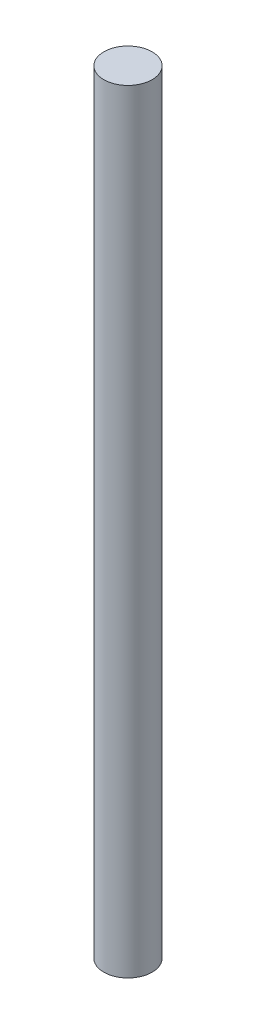
ISO-10303-21;
HEADER;
FILE_DESCRIPTION(('STEP AP214'),'2;1');
FILE_NAME('part.step','',(''),(''),'','','');
FILE_SCHEMA(('AUTOMOTIVE_DESIGN { 1 0 10303 214 1 1 1 1 }'));
ENDSEC;
DATA;
#1=APPLICATION_CONTEXT('core data for automotive mechanical design processes');
#2=APPLICATION_PROTOCOL_DEFINITION('international standard','automotive_design',2000,#1);
#3=PRODUCT_CONTEXT('',#1,'mechanical');
#4=PRODUCT('Part','Part','',(#3));
#5=PRODUCT_RELATED_PRODUCT_CATEGORY('part','',(#4));
#6=PRODUCT_DEFINITION_FORMATION('','',#4);
#7=PRODUCT_DEFINITION_CONTEXT('part definition',#1,'design');
#8=PRODUCT_DEFINITION('design','',#6,#7);
#9=PRODUCT_DEFINITION_SHAPE('','',#8);
#10=(LENGTH_UNIT() NAMED_UNIT(*) SI_UNIT(.MILLI.,.METRE.));
#11=(NAMED_UNIT(*) PLANE_ANGLE_UNIT() SI_UNIT($,.RADIAN.));
#12=(NAMED_UNIT(*) SI_UNIT($,.STERADIAN.) SOLID_ANGLE_UNIT());
#13=UNCERTAINTY_MEASURE_WITH_UNIT(LENGTH_MEASURE(1.E-05),#10,'distance_accuracy_value','');
#14=(GEOMETRIC_REPRESENTATION_CONTEXT(3) GLOBAL_UNCERTAINTY_ASSIGNED_CONTEXT((#13)) GLOBAL_UNIT_ASSIGNED_CONTEXT((#10,
#11,#12)) REPRESENTATION_CONTEXT('',''));
#15=CARTESIAN_POINT('',(0.,0.,0.));
#16=DIRECTION('',(0.,0.,1.));
#17=DIRECTION('',(1.,0.,0.));
#18=AXIS2_PLACEMENT_3D('',#15,#16,#17);
#19=CARTESIAN_POINT('',(0.,50.8,0.));
#20=DIRECTION('',(0.,-1.,0.));
#21=DIRECTION('',(0.,0.,-1.));
#22=AXIS2_PLACEMENT_3D('',#19,#20,#21);
#23=CYLINDRICAL_SURFACE('',#22,1.5875);
#24=CARTESIAN_POINT('',(0.,50.8,0.));
#25=DIRECTION('',(0.,1.,0.));
#26=DIRECTION('',(0.,0.,1.));
#27=AXIS2_PLACEMENT_3D('',#24,#25,#26);
#28=CIRCLE('',#27,1.5875);
#29=CARTESIAN_POINT('',(0.,50.8,1.5875));
#30=VERTEX_POINT('',#29);
#31=EDGE_CURVE('E10',#30,#30,#28,.T.);
#32=ORIENTED_EDGE('',*,*,#31,.F.);
#33=EDGE_LOOP('',(#32));
#34=FACE_BOUND('',#33,.T.);
#35=CARTESIAN_POINT('',(0.,0.,0.));
#36=DIRECTION('',(0.,1.,0.));
#37=DIRECTION('',(0.,0.,1.));
#38=AXIS2_PLACEMENT_3D('',#35,#36,#37);
#39=CIRCLE('',#38,1.5875);
#40=CARTESIAN_POINT('',(0.,0.,1.5875));
#41=VERTEX_POINT('',#40);
#42=EDGE_CURVE('E34',#41,#41,#39,.T.);
#43=ORIENTED_EDGE('',*,*,#42,.T.);
#44=EDGE_LOOP('',(#43));
#45=FACE_BOUND('',#44,.T.);
#46=ADVANCED_FACE('F31',(#34,#45),#23,.T.);
#47=CARTESIAN_POINT('',(0.,50.8,0.));
#48=DIRECTION('',(0.,1.,0.));
#49=DIRECTION('',(0.,0.,1.));
#50=AXIS2_PLACEMENT_3D('',#47,#48,#49);
#51=PLANE('',#50);
#52=ORIENTED_EDGE('',*,*,#31,.T.);
#53=EDGE_LOOP('',(#52));
#54=FACE_BOUND('',#53,.T.);
#55=ADVANCED_FACE('F46',(#54),#51,.T.);
#56=CARTESIAN_POINT('',(0.,0.,0.));
#57=DIRECTION('',(0.,1.,0.));
#58=DIRECTION('',(0.,0.,1.));
#59=AXIS2_PLACEMENT_3D('',#56,#57,#58);
#60=PLANE('',#59);
#61=ORIENTED_EDGE('',*,*,#42,.F.);
#62=EDGE_LOOP('',(#61));
#63=FACE_BOUND('',#62,.T.);
#64=ADVANCED_FACE('F44',(#63),#60,.F.);
#65=CLOSED_SHELL('',(#46,#55,#64));
#66=MANIFOLD_SOLID_BREP('B2',#65);
#67=ADVANCED_BREP_SHAPE_REPRESENTATION('',(#18,#66),#14);
#68=SHAPE_DEFINITION_REPRESENTATION(#9,#67);
ENDSEC;
END-ISO-10303-21;
